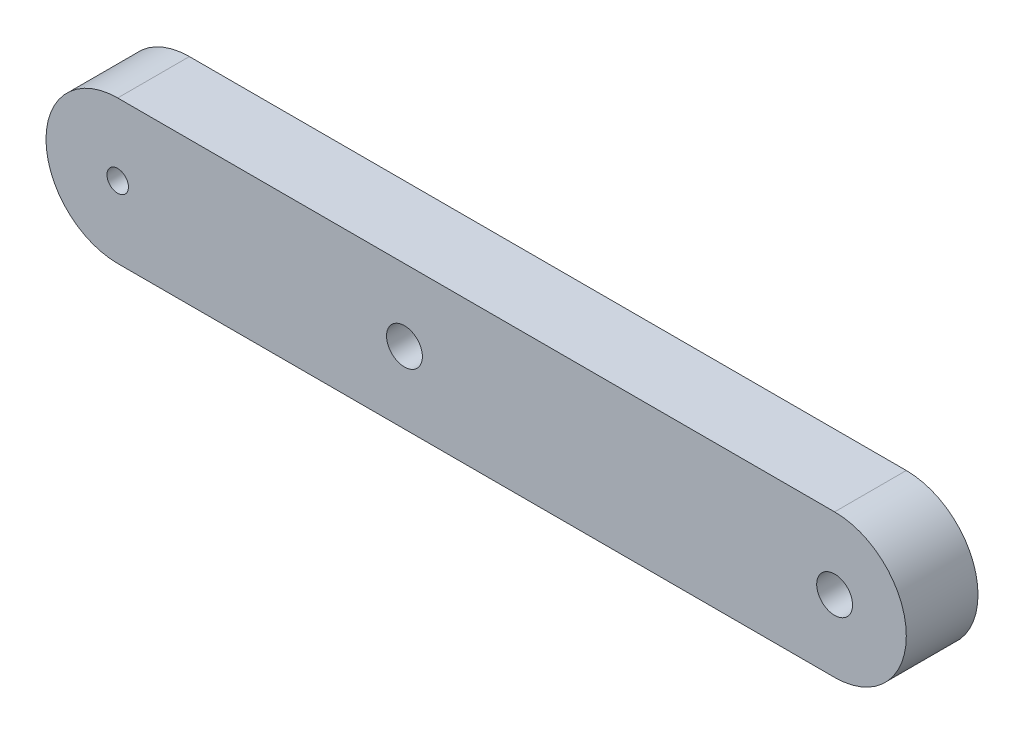
ISO-10303-21;
HEADER;
FILE_DESCRIPTION(('STEP AP214'),'2;1');
FILE_NAME('part.step','',(''),(''),'','','');
FILE_SCHEMA(('AUTOMOTIVE_DESIGN { 1 0 10303 214 1 1 1 1 }'));
ENDSEC;
DATA;
#1=APPLICATION_CONTEXT('core data for automotive mechanical design processes');
#2=APPLICATION_PROTOCOL_DEFINITION('international standard','automotive_design',2000,#1);
#3=PRODUCT_CONTEXT('',#1,'mechanical');
#4=PRODUCT('Part','Part','',(#3));
#5=PRODUCT_RELATED_PRODUCT_CATEGORY('part','',(#4));
#6=PRODUCT_DEFINITION_FORMATION('','',#4);
#7=PRODUCT_DEFINITION_CONTEXT('part definition',#1,'design');
#8=PRODUCT_DEFINITION('design','',#6,#7);
#9=PRODUCT_DEFINITION_SHAPE('','',#8);
#10=(LENGTH_UNIT() NAMED_UNIT(*) SI_UNIT(.MILLI.,.METRE.));
#11=(NAMED_UNIT(*) PLANE_ANGLE_UNIT() SI_UNIT($,.RADIAN.));
#12=(NAMED_UNIT(*) SI_UNIT($,.STERADIAN.) SOLID_ANGLE_UNIT());
#13=UNCERTAINTY_MEASURE_WITH_UNIT(LENGTH_MEASURE(1.E-05),#10,'distance_accuracy_value','');
#14=(GEOMETRIC_REPRESENTATION_CONTEXT(3) GLOBAL_UNCERTAINTY_ASSIGNED_CONTEXT((#13)) GLOBAL_UNIT_ASSIGNED_CONTEXT((#10,
#11,#12)) REPRESENTATION_CONTEXT('',''));
#15=CARTESIAN_POINT('',(0.,0.,0.));
#16=DIRECTION('',(0.,0.,1.));
#17=DIRECTION('',(1.,0.,0.));
#18=AXIS2_PLACEMENT_3D('',#15,#16,#17);
#19=CARTESIAN_POINT('',(60.,10.,10.));
#20=DIRECTION('',(0.,0.,-1.));
#21=DIRECTION('',(-1.,0.,0.));
#22=AXIS2_PLACEMENT_3D('',#19,#20,#21);
#23=PLANE('',#22);
#24=CARTESIAN_POINT('',(60.,10.,10.));
#25=DIRECTION('',(0.,0.,1.));
#26=DIRECTION('',(-1.,0.,0.));
#27=AXIS2_PLACEMENT_3D('',#24,#25,#26);
#28=CIRCLE('',#27,10.);
#29=CARTESIAN_POINT('',(60.,0.,10.));
#30=VERTEX_POINT('',#29);
#31=CARTESIAN_POINT('',(60.,20.,10.));
#32=VERTEX_POINT('',#31);
#33=EDGE_CURVE('E85',#30,#32,#28,.T.);
#34=ORIENTED_EDGE('',*,*,#33,.T.);
#35=DIRECTION('',(-1.,0.,0.));
#36=VECTOR('',#35,1.);
#37=CARTESIAN_POINT('',(-40.,20.,10.));
#38=LINE('',#37,#36);
#39=CARTESIAN_POINT('',(-40.,20.,10.));
#40=VERTEX_POINT('',#39);
#41=EDGE_CURVE('E80',#32,#40,#38,.T.);
#42=ORIENTED_EDGE('',*,*,#41,.T.);
#43=CARTESIAN_POINT('',(-40.,10.,10.));
#44=DIRECTION('',(0.,0.,1.));
#45=DIRECTION('',(1.,0.,0.));
#46=AXIS2_PLACEMENT_3D('',#43,#44,#45);
#47=CIRCLE('',#46,10.);
#48=CARTESIAN_POINT('',(-40.,0.,10.));
#49=VERTEX_POINT('',#48);
#50=EDGE_CURVE('E83',#40,#49,#47,.T.);
#51=ORIENTED_EDGE('',*,*,#50,.T.);
#52=DIRECTION('',(1.,0.,0.));
#53=VECTOR('',#52,1.);
#54=CARTESIAN_POINT('',(-40.,0.,10.));
#55=LINE('',#54,#53);
#56=EDGE_CURVE('E50',#49,#30,#55,.T.);
#57=ORIENTED_EDGE('',*,*,#56,.T.);
#58=EDGE_LOOP('',(#34,#42,#51,#57));
#59=FACE_BOUND('',#58,.T.);
#60=CARTESIAN_POINT('',(0.,10.,10.));
#61=DIRECTION('',(0.,0.,1.));
#62=DIRECTION('',(1.,0.,0.));
#63=AXIS2_PLACEMENT_3D('',#60,#61,#62);
#64=CIRCLE('',#63,2.5);
#65=CARTESIAN_POINT('',(2.5,10.,10.));
#66=VERTEX_POINT('',#65);
#67=EDGE_CURVE('E100',#66,#66,#64,.T.);
#68=ORIENTED_EDGE('',*,*,#67,.F.);
#69=EDGE_LOOP('',(#68));
#70=FACE_BOUND('',#69,.T.);
#71=CARTESIAN_POINT('',(60.,10.,10.));
#72=DIRECTION('',(0.,0.,1.));
#73=DIRECTION('',(1.,0.,0.));
#74=AXIS2_PLACEMENT_3D('',#71,#72,#73);
#75=CIRCLE('',#74,2.5);
#76=CARTESIAN_POINT('',(62.5,10.,10.));
#77=VERTEX_POINT('',#76);
#78=EDGE_CURVE('E115',#77,#77,#75,.T.);
#79=ORIENTED_EDGE('',*,*,#78,.F.);
#80=EDGE_LOOP('',(#79));
#81=FACE_BOUND('',#80,.T.);
#82=CARTESIAN_POINT('',(-40.,9.98358211799638,10.));
#83=DIRECTION('',(0.,0.,1.));
#84=DIRECTION('',(1.,0.,0.));
#85=AXIS2_PLACEMENT_3D('',#82,#83,#84);
#86=CIRCLE('',#85,1.5);
#87=CARTESIAN_POINT('',(-38.5,9.98358211799638,10.));
#88=VERTEX_POINT('',#87);
#89=EDGE_CURVE('E121',#88,#88,#86,.T.);
#90=ORIENTED_EDGE('',*,*,#89,.F.);
#91=EDGE_LOOP('',(#90));
#92=FACE_BOUND('',#91,.T.);
#93=ADVANCED_FACE('F33',(#59,#70,#81,#92),#23,.F.);
#94=CARTESIAN_POINT('',(60.,10.,0.));
#95=DIRECTION('',(0.,0.,-1.));
#96=DIRECTION('',(-1.,0.,0.));
#97=AXIS2_PLACEMENT_3D('',#94,#95,#96);
#98=PLANE('',#97);
#99=CARTESIAN_POINT('',(60.,10.,0.));
#100=DIRECTION('',(0.,0.,1.));
#101=DIRECTION('',(1.,0.,0.));
#102=AXIS2_PLACEMENT_3D('',#99,#100,#101);
#103=CIRCLE('',#102,2.5);
#104=CARTESIAN_POINT('',(62.5,10.,0.));
#105=VERTEX_POINT('',#104);
#106=EDGE_CURVE('E118',#105,#105,#103,.T.);
#107=ORIENTED_EDGE('',*,*,#106,.T.);
#108=EDGE_LOOP('',(#107));
#109=FACE_BOUND('',#108,.T.);
#110=CARTESIAN_POINT('',(60.,10.,0.));
#111=DIRECTION('',(0.,0.,1.));
#112=DIRECTION('',(-1.,0.,0.));
#113=AXIS2_PLACEMENT_3D('',#110,#111,#112);
#114=CIRCLE('',#113,10.);
#115=CARTESIAN_POINT('',(60.,0.,0.));
#116=VERTEX_POINT('',#115);
#117=CARTESIAN_POINT('',(60.,20.,0.));
#118=VERTEX_POINT('',#117);
#119=EDGE_CURVE('E97',#116,#118,#114,.T.);
#120=ORIENTED_EDGE('',*,*,#119,.F.);
#121=DIRECTION('',(1.,0.,0.));
#122=VECTOR('',#121,1.);
#123=CARTESIAN_POINT('',(-40.,0.,0.));
#124=LINE('',#123,#122);
#125=CARTESIAN_POINT('',(-40.,0.,0.));
#126=VERTEX_POINT('',#125);
#127=EDGE_CURVE('E73',#126,#116,#124,.T.);
#128=ORIENTED_EDGE('',*,*,#127,.F.);
#129=CARTESIAN_POINT('',(-40.,10.,0.));
#130=DIRECTION('',(0.,0.,1.));
#131=DIRECTION('',(1.,0.,0.));
#132=AXIS2_PLACEMENT_3D('',#129,#130,#131);
#133=CIRCLE('',#132,10.);
#134=CARTESIAN_POINT('',(-40.,20.,0.));
#135=VERTEX_POINT('',#134);
#136=EDGE_CURVE('E67',#135,#126,#133,.T.);
#137=ORIENTED_EDGE('',*,*,#136,.F.);
#138=DIRECTION('',(-1.,0.,0.));
#139=VECTOR('',#138,1.);
#140=CARTESIAN_POINT('',(-40.,20.,0.));
#141=LINE('',#140,#139);
#142=EDGE_CURVE('E89',#118,#135,#141,.T.);
#143=ORIENTED_EDGE('',*,*,#142,.F.);
#144=EDGE_LOOP('',(#120,#128,#137,#143));
#145=FACE_BOUND('',#144,.T.);
#146=CARTESIAN_POINT('',(0.,10.,0.));
#147=DIRECTION('',(0.,0.,1.));
#148=DIRECTION('',(1.,0.,0.));
#149=AXIS2_PLACEMENT_3D('',#146,#147,#148);
#150=CIRCLE('',#149,2.5);
#151=CARTESIAN_POINT('',(2.5,10.,0.));
#152=VERTEX_POINT('',#151);
#153=EDGE_CURVE('E112',#152,#152,#150,.T.);
#154=ORIENTED_EDGE('',*,*,#153,.T.);
#155=EDGE_LOOP('',(#154));
#156=FACE_BOUND('',#155,.T.);
#157=CARTESIAN_POINT('',(-40.,9.98358211799638,0.));
#158=DIRECTION('',(0.,0.,1.));
#159=DIRECTION('',(1.,0.,0.));
#160=AXIS2_PLACEMENT_3D('',#157,#158,#159);
#161=CIRCLE('',#160,1.5);
#162=CARTESIAN_POINT('',(-38.5,9.98358211799638,0.));
#163=VERTEX_POINT('',#162);
#164=EDGE_CURVE('E124',#163,#163,#161,.T.);
#165=ORIENTED_EDGE('',*,*,#164,.T.);
#166=EDGE_LOOP('',(#165));
#167=FACE_BOUND('',#166,.T.);
#168=ADVANCED_FACE('F108',(#109,#145,#156,#167),#98,.T.);
#169=CARTESIAN_POINT('',(60.,10.,10.));
#170=DIRECTION('',(0.,0.,-1.));
#171=DIRECTION('',(-1.,0.,0.));
#172=AXIS2_PLACEMENT_3D('',#169,#170,#171);
#173=CYLINDRICAL_SURFACE('',#172,10.);
#174=ORIENTED_EDGE('',*,*,#119,.T.);
#175=DIRECTION('',(0.,0.,-1.));
#176=VECTOR('',#175,1.);
#177=CARTESIAN_POINT('',(60.,20.,10.));
#178=LINE('',#177,#176);
#179=EDGE_CURVE('E11',#32,#118,#178,.T.);
#180=ORIENTED_EDGE('',*,*,#179,.F.);
#181=ORIENTED_EDGE('',*,*,#33,.F.);
#182=DIRECTION('',(0.,0.,-1.));
#183=VECTOR('',#182,1.);
#184=CARTESIAN_POINT('',(60.,0.,10.));
#185=LINE('',#184,#183);
#186=EDGE_CURVE('E93',#30,#116,#185,.T.);
#187=ORIENTED_EDGE('',*,*,#186,.T.);
#188=EDGE_LOOP('',(#174,#180,#181,#187));
#189=FACE_BOUND('',#188,.T.);
#190=ADVANCED_FACE('F35',(#189),#173,.T.);
#191=CARTESIAN_POINT('',(-40.,20.,10.));
#192=DIRECTION('',(0.,-1.,0.));
#193=DIRECTION('',(0.,0.,-1.));
#194=AXIS2_PLACEMENT_3D('',#191,#192,#193);
#195=PLANE('',#194);
#196=ORIENTED_EDGE('',*,*,#142,.T.);
#197=DIRECTION('',(0.,0.,-1.));
#198=VECTOR('',#197,1.);
#199=CARTESIAN_POINT('',(-40.,20.,10.));
#200=LINE('',#199,#198);
#201=EDGE_CURVE('E42',#40,#135,#200,.T.);
#202=ORIENTED_EDGE('',*,*,#201,.F.);
#203=ORIENTED_EDGE('',*,*,#41,.F.);
#204=ORIENTED_EDGE('',*,*,#179,.T.);
#205=EDGE_LOOP('',(#196,#202,#203,#204));
#206=FACE_BOUND('',#205,.T.);
#207=ADVANCED_FACE('F88',(#206),#195,.F.);
#208=CARTESIAN_POINT('',(-40.,10.,10.));
#209=DIRECTION('',(0.,0.,-1.));
#210=DIRECTION('',(-1.,0.,0.));
#211=AXIS2_PLACEMENT_3D('',#208,#209,#210);
#212=CYLINDRICAL_SURFACE('',#211,10.);
#213=ORIENTED_EDGE('',*,*,#136,.T.);
#214=DIRECTION('',(0.,0.,-1.));
#215=VECTOR('',#214,1.);
#216=CARTESIAN_POINT('',(-40.,0.,10.));
#217=LINE('',#216,#215);
#218=EDGE_CURVE('E90',#49,#126,#217,.T.);
#219=ORIENTED_EDGE('',*,*,#218,.F.);
#220=ORIENTED_EDGE('',*,*,#50,.F.);
#221=ORIENTED_EDGE('',*,*,#201,.T.);
#222=EDGE_LOOP('',(#213,#219,#220,#221));
#223=FACE_BOUND('',#222,.T.);
#224=ADVANCED_FACE('F91',(#223),#212,.T.);
#225=CARTESIAN_POINT('',(-40.,0.,10.));
#226=DIRECTION('',(0.,1.,0.));
#227=DIRECTION('',(-1.,0.,0.));
#228=AXIS2_PLACEMENT_3D('',#225,#226,#227);
#229=PLANE('',#228);
#230=ORIENTED_EDGE('',*,*,#127,.T.);
#231=ORIENTED_EDGE('',*,*,#186,.F.);
#232=ORIENTED_EDGE('',*,*,#56,.F.);
#233=ORIENTED_EDGE('',*,*,#218,.T.);
#234=EDGE_LOOP('',(#230,#231,#232,#233));
#235=FACE_BOUND('',#234,.T.);
#236=ADVANCED_FACE('F105',(#235),#229,.F.);
#237=CARTESIAN_POINT('',(0.,10.,10.));
#238=DIRECTION('',(0.,0.,-1.));
#239=DIRECTION('',(-1.,0.,0.));
#240=AXIS2_PLACEMENT_3D('',#237,#238,#239);
#241=CYLINDRICAL_SURFACE('',#240,2.5);
#242=ORIENTED_EDGE('',*,*,#67,.T.);
#243=EDGE_LOOP('',(#242));
#244=FACE_BOUND('',#243,.T.);
#245=ORIENTED_EDGE('',*,*,#153,.F.);
#246=EDGE_LOOP('',(#245));
#247=FACE_BOUND('',#246,.T.);
#248=ADVANCED_FACE('F141',(#244,#247),#241,.F.);
#249=CARTESIAN_POINT('',(60.,10.,10.));
#250=DIRECTION('',(0.,0.,-1.));
#251=DIRECTION('',(-1.,0.,0.));
#252=AXIS2_PLACEMENT_3D('',#249,#250,#251);
#253=CYLINDRICAL_SURFACE('',#252,2.5);
#254=ORIENTED_EDGE('',*,*,#78,.T.);
#255=EDGE_LOOP('',(#254));
#256=FACE_BOUND('',#255,.T.);
#257=ORIENTED_EDGE('',*,*,#106,.F.);
#258=EDGE_LOOP('',(#257));
#259=FACE_BOUND('',#258,.T.);
#260=ADVANCED_FACE('F187',(#256,#259),#253,.F.);
#261=CARTESIAN_POINT('',(-40.,9.98358211799638,10.));
#262=DIRECTION('',(0.,0.,-1.));
#263=DIRECTION('',(-1.,0.,0.));
#264=AXIS2_PLACEMENT_3D('',#261,#262,#263);
#265=CYLINDRICAL_SURFACE('',#264,1.5);
#266=ORIENTED_EDGE('',*,*,#89,.T.);
#267=EDGE_LOOP('',(#266));
#268=FACE_BOUND('',#267,.T.);
#269=ORIENTED_EDGE('',*,*,#164,.F.);
#270=EDGE_LOOP('',(#269));
#271=FACE_BOUND('',#270,.T.);
#272=ADVANCED_FACE('F130',(#268,#271),#265,.F.);
#273=CLOSED_SHELL('',(#93,#168,#190,#207,#224,#236,#248,#260,#272));
#274=MANIFOLD_SOLID_BREP('B2',#273);
#275=ADVANCED_BREP_SHAPE_REPRESENTATION('',(#18,#274),#14);
#276=SHAPE_DEFINITION_REPRESENTATION(#9,#275);
ENDSEC;
END-ISO-10303-21;
